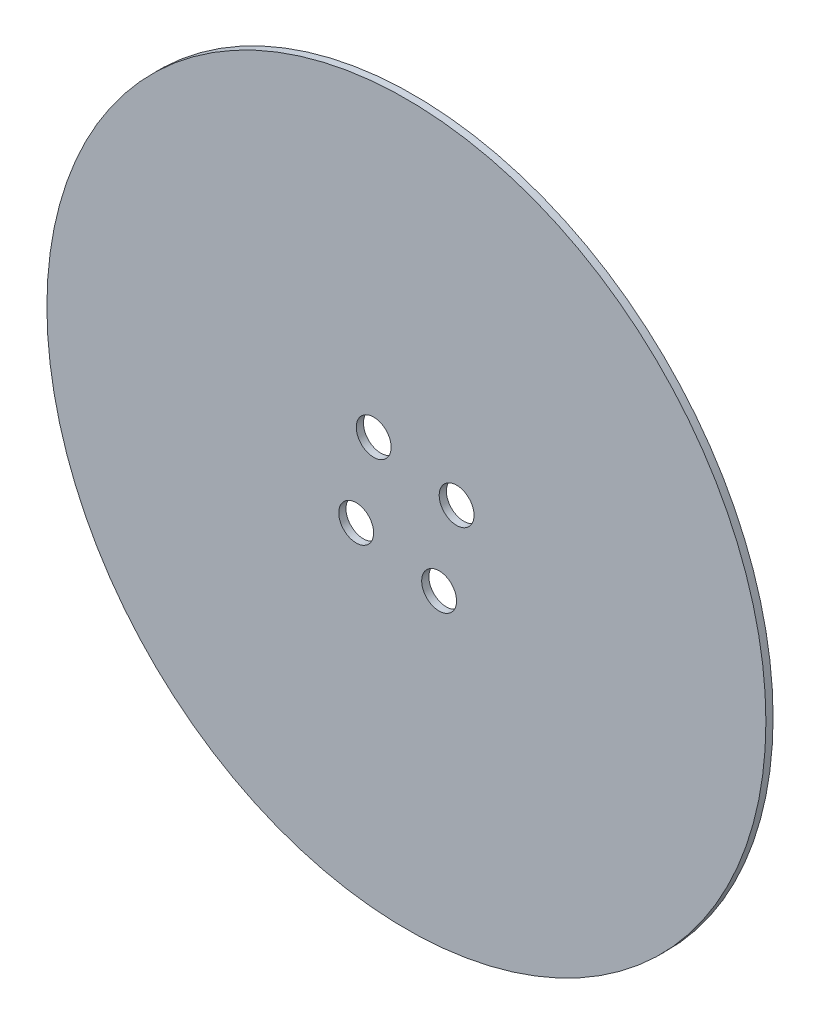
ISO-10303-21;
HEADER;
FILE_DESCRIPTION(('STEP AP214'),'2;1');
FILE_NAME('part.step','',(''),(''),'','','');
FILE_SCHEMA(('AUTOMOTIVE_DESIGN { 1 0 10303 214 1 1 1 1 }'));
ENDSEC;
DATA;
#1=APPLICATION_CONTEXT('core data for automotive mechanical design processes');
#2=APPLICATION_PROTOCOL_DEFINITION('international standard','automotive_design',2000,#1);
#3=PRODUCT_CONTEXT('',#1,'mechanical');
#4=PRODUCT('Part','Part','',(#3));
#5=PRODUCT_RELATED_PRODUCT_CATEGORY('part','',(#4));
#6=PRODUCT_DEFINITION_FORMATION('','',#4);
#7=PRODUCT_DEFINITION_CONTEXT('part definition',#1,'design');
#8=PRODUCT_DEFINITION('design','',#6,#7);
#9=PRODUCT_DEFINITION_SHAPE('','',#8);
#10=(LENGTH_UNIT() NAMED_UNIT(*) SI_UNIT(.MILLI.,.METRE.));
#11=(NAMED_UNIT(*) PLANE_ANGLE_UNIT() SI_UNIT($,.RADIAN.));
#12=(NAMED_UNIT(*) SI_UNIT($,.STERADIAN.) SOLID_ANGLE_UNIT());
#13=UNCERTAINTY_MEASURE_WITH_UNIT(LENGTH_MEASURE(1.E-05),#10,'distance_accuracy_value','');
#14=(GEOMETRIC_REPRESENTATION_CONTEXT(3) GLOBAL_UNCERTAINTY_ASSIGNED_CONTEXT((#13)) GLOBAL_UNIT_ASSIGNED_CONTEXT((#10,
#11,#12)) REPRESENTATION_CONTEXT('',''));
#15=CARTESIAN_POINT('',(0.,0.,0.));
#16=DIRECTION('',(0.,0.,1.));
#17=DIRECTION('',(1.,0.,0.));
#18=AXIS2_PLACEMENT_3D('',#15,#16,#17);
#19=CARTESIAN_POINT('',(0.,8.74300631892311E-13,3.));
#20=DIRECTION('',(0.,0.,-1.));
#21=DIRECTION('',(-1.,0.,0.));
#22=AXIS2_PLACEMENT_3D('',#19,#20,#21);
#23=CYLINDRICAL_SURFACE('',#22,150.000000000006);
#24=CARTESIAN_POINT('',(0.,8.74300631892311E-13,3.));
#25=DIRECTION('',(0.,0.,1.));
#26=DIRECTION('',(1.,0.,0.));
#27=AXIS2_PLACEMENT_3D('',#24,#25,#26);
#28=CIRCLE('',#27,150.000000000006);
#29=CARTESIAN_POINT('',(150.000000000006,8.74300631892311E-13,3.));
#30=VERTEX_POINT('',#29);
#31=EDGE_CURVE('E10',#30,#30,#28,.T.);
#32=ORIENTED_EDGE('',*,*,#31,.F.);
#33=EDGE_LOOP('',(#32));
#34=FACE_BOUND('',#33,.T.);
#35=CARTESIAN_POINT('',(0.,8.74300631892311E-13,0.));
#36=DIRECTION('',(0.,0.,1.));
#37=DIRECTION('',(1.,0.,0.));
#38=AXIS2_PLACEMENT_3D('',#35,#36,#37);
#39=CIRCLE('',#38,150.000000000006);
#40=CARTESIAN_POINT('',(150.000000000006,8.74300631892311E-13,0.));
#41=VERTEX_POINT('',#40);
#42=EDGE_CURVE('E49',#41,#41,#39,.T.);
#43=ORIENTED_EDGE('',*,*,#42,.T.);
#44=EDGE_LOOP('',(#43));
#45=FACE_BOUND('',#44,.T.);
#46=ADVANCED_FACE('F41',(#34,#45),#23,.T.);
#47=CARTESIAN_POINT('',(0.,8.74300631892311E-13,3.));
#48=DIRECTION('',(0.,0.,1.));
#49=DIRECTION('',(1.,0.,0.));
#50=AXIS2_PLACEMENT_3D('',#47,#48,#49);
#51=PLANE('',#50);
#52=CARTESIAN_POINT('',(20.9486186436359,13.6438769022421,3.));
#53=DIRECTION('',(0.,0.,1.));
#54=DIRECTION('',(1.,0.,0.));
#55=AXIS2_PLACEMENT_3D('',#52,#53,#54);
#56=CIRCLE('',#55,7.275);
#57=CARTESIAN_POINT('',(28.2236186436359,13.6438769022421,3.));
#58=VERTEX_POINT('',#57);
#59=EDGE_CURVE('E80',#58,#58,#56,.T.);
#60=ORIENTED_EDGE('',*,*,#59,.F.);
#61=EDGE_LOOP('',(#60));
#62=FACE_BOUND('',#61,.T.);
#63=CARTESIAN_POINT('',(-13.6438769022413,20.9486186436367,3.));
#64=DIRECTION('',(0.,0.,1.));
#65=DIRECTION('',(1.,0.,0.));
#66=AXIS2_PLACEMENT_3D('',#63,#64,#65);
#67=CIRCLE('',#66,7.275);
#68=CARTESIAN_POINT('',(-6.36887690224131,20.9486186436367,3.));
#69=VERTEX_POINT('',#68);
#70=EDGE_CURVE('E44',#69,#69,#67,.T.);
#71=ORIENTED_EDGE('',*,*,#70,.F.);
#72=EDGE_LOOP('',(#71));
#73=FACE_BOUND('',#72,.T.);
#74=CARTESIAN_POINT('',(-20.9486186436359,-13.6438769022405,3.));
#75=DIRECTION('',(0.,0.,1.));
#76=DIRECTION('',(1.,0.,0.));
#77=AXIS2_PLACEMENT_3D('',#74,#75,#76);
#78=CIRCLE('',#77,7.275);
#79=CARTESIAN_POINT('',(-13.6736186436359,-13.6438769022405,3.));
#80=VERTEX_POINT('',#79);
#81=EDGE_CURVE('E59',#80,#80,#78,.T.);
#82=ORIENTED_EDGE('',*,*,#81,.F.);
#83=EDGE_LOOP('',(#82));
#84=FACE_BOUND('',#83,.T.);
#85=CARTESIAN_POINT('',(13.6438769022413,-20.9486186436351,3.));
#86=DIRECTION('',(0.,0.,1.));
#87=DIRECTION('',(1.,0.,0.));
#88=AXIS2_PLACEMENT_3D('',#85,#86,#87);
#89=CIRCLE('',#88,7.275);
#90=CARTESIAN_POINT('',(20.9188769022413,-20.9486186436351,3.));
#91=VERTEX_POINT('',#90);
#92=EDGE_CURVE('E55',#91,#91,#89,.T.);
#93=ORIENTED_EDGE('',*,*,#92,.F.);
#94=EDGE_LOOP('',(#93));
#95=FACE_BOUND('',#94,.T.);
#96=ORIENTED_EDGE('',*,*,#31,.T.);
#97=EDGE_LOOP('',(#96));
#98=FACE_BOUND('',#97,.T.);
#99=ADVANCED_FACE('F95',(#62,#73,#84,#95,#98),#51,.T.);
#100=CARTESIAN_POINT('',(0.,8.74300631892311E-13,0.));
#101=DIRECTION('',(0.,0.,1.));
#102=DIRECTION('',(1.,0.,0.));
#103=AXIS2_PLACEMENT_3D('',#100,#101,#102);
#104=PLANE('',#103);
#105=CARTESIAN_POINT('',(20.9486186436359,13.6438769022421,0.));
#106=DIRECTION('',(0.,0.,-1.));
#107=DIRECTION('',(-1.,0.,0.));
#108=AXIS2_PLACEMENT_3D('',#105,#106,#107);
#109=CIRCLE('',#108,7.275);
#110=CARTESIAN_POINT('',(13.6736186436359,13.6438769022421,0.));
#111=VERTEX_POINT('',#110);
#112=EDGE_CURVE('E84',#111,#111,#109,.T.);
#113=ORIENTED_EDGE('',*,*,#112,.F.);
#114=EDGE_LOOP('',(#113));
#115=FACE_BOUND('',#114,.T.);
#116=CARTESIAN_POINT('',(-13.6438769022413,20.9486186436367,0.));
#117=DIRECTION('',(0.,0.,-1.));
#118=DIRECTION('',(-1.,0.,0.));
#119=AXIS2_PLACEMENT_3D('',#116,#117,#118);
#120=CIRCLE('',#119,7.275);
#121=CARTESIAN_POINT('',(-20.9188769022413,20.9486186436367,0.));
#122=VERTEX_POINT('',#121);
#123=EDGE_CURVE('E75',#122,#122,#120,.T.);
#124=ORIENTED_EDGE('',*,*,#123,.F.);
#125=EDGE_LOOP('',(#124));
#126=FACE_BOUND('',#125,.T.);
#127=CARTESIAN_POINT('',(-20.9486186436359,-13.6438769022405,0.));
#128=DIRECTION('',(0.,0.,-1.));
#129=DIRECTION('',(-1.,0.,0.));
#130=AXIS2_PLACEMENT_3D('',#127,#128,#129);
#131=CIRCLE('',#130,7.275);
#132=CARTESIAN_POINT('',(-28.2236186436359,-13.6438769022405,0.));
#133=VERTEX_POINT('',#132);
#134=EDGE_CURVE('E63',#133,#133,#131,.T.);
#135=ORIENTED_EDGE('',*,*,#134,.F.);
#136=EDGE_LOOP('',(#135));
#137=FACE_BOUND('',#136,.T.);
#138=CARTESIAN_POINT('',(13.6438769022413,-20.9486186436351,0.));
#139=DIRECTION('',(0.,0.,-1.));
#140=DIRECTION('',(-1.,0.,0.));
#141=AXIS2_PLACEMENT_3D('',#138,#139,#140);
#142=CIRCLE('',#141,7.275);
#143=CARTESIAN_POINT('',(6.36887690224131,-20.9486186436351,0.));
#144=VERTEX_POINT('',#143);
#145=EDGE_CURVE('E62',#144,#144,#142,.T.);
#146=ORIENTED_EDGE('',*,*,#145,.F.);
#147=EDGE_LOOP('',(#146));
#148=FACE_BOUND('',#147,.T.);
#149=ORIENTED_EDGE('',*,*,#42,.F.);
#150=EDGE_LOOP('',(#149));
#151=FACE_BOUND('',#150,.T.);
#152=ADVANCED_FACE('F91',(#115,#126,#137,#148,#151),#104,.F.);
#153=CARTESIAN_POINT('',(13.6438769022413,-20.9486186436351,0.));
#154=DIRECTION('',(0.,0.,-1.));
#155=DIRECTION('',(-1.,0.,0.));
#156=AXIS2_PLACEMENT_3D('',#153,#154,#155);
#157=CYLINDRICAL_SURFACE('',#156,7.275);
#158=ORIENTED_EDGE('',*,*,#92,.T.);
#159=EDGE_LOOP('',(#158));
#160=FACE_BOUND('',#159,.T.);
#161=ORIENTED_EDGE('',*,*,#145,.T.);
#162=EDGE_LOOP('',(#161));
#163=FACE_BOUND('',#162,.T.);
#164=ADVANCED_FACE('F94',(#160,#163),#157,.F.);
#165=CARTESIAN_POINT('',(-20.9486186436359,-13.6438769022405,0.));
#166=DIRECTION('',(0.,0.,-1.));
#167=DIRECTION('',(-1.,0.,0.));
#168=AXIS2_PLACEMENT_3D('',#165,#166,#167);
#169=CYLINDRICAL_SURFACE('',#168,7.275);
#170=ORIENTED_EDGE('',*,*,#81,.T.);
#171=EDGE_LOOP('',(#170));
#172=FACE_BOUND('',#171,.T.);
#173=ORIENTED_EDGE('',*,*,#134,.T.);
#174=EDGE_LOOP('',(#173));
#175=FACE_BOUND('',#174,.T.);
#176=ADVANCED_FACE('F117',(#172,#175),#169,.F.);
#177=CARTESIAN_POINT('',(-13.6438769022413,20.9486186436367,0.));
#178=DIRECTION('',(0.,0.,-1.));
#179=DIRECTION('',(-1.,0.,0.));
#180=AXIS2_PLACEMENT_3D('',#177,#178,#179);
#181=CYLINDRICAL_SURFACE('',#180,7.275);
#182=ORIENTED_EDGE('',*,*,#70,.T.);
#183=EDGE_LOOP('',(#182));
#184=FACE_BOUND('',#183,.T.);
#185=ORIENTED_EDGE('',*,*,#123,.T.);
#186=EDGE_LOOP('',(#185));
#187=FACE_BOUND('',#186,.T.);
#188=ADVANCED_FACE('F121',(#184,#187),#181,.F.);
#189=CARTESIAN_POINT('',(20.9486186436359,13.6438769022421,0.));
#190=DIRECTION('',(0.,0.,-1.));
#191=DIRECTION('',(-1.,0.,0.));
#192=AXIS2_PLACEMENT_3D('',#189,#190,#191);
#193=CYLINDRICAL_SURFACE('',#192,7.275);
#194=ORIENTED_EDGE('',*,*,#59,.T.);
#195=EDGE_LOOP('',(#194));
#196=FACE_BOUND('',#195,.T.);
#197=ORIENTED_EDGE('',*,*,#112,.T.);
#198=EDGE_LOOP('',(#197));
#199=FACE_BOUND('',#198,.T.);
#200=ADVANCED_FACE('F89',(#196,#199),#193,.F.);
#201=CLOSED_SHELL('',(#46,#99,#152,#164,#176,#188,#200));
#202=MANIFOLD_SOLID_BREP('B2',#201);
#203=ADVANCED_BREP_SHAPE_REPRESENTATION('',(#18,#202),#14);
#204=SHAPE_DEFINITION_REPRESENTATION(#9,#203);
ENDSEC;
END-ISO-10303-21;
